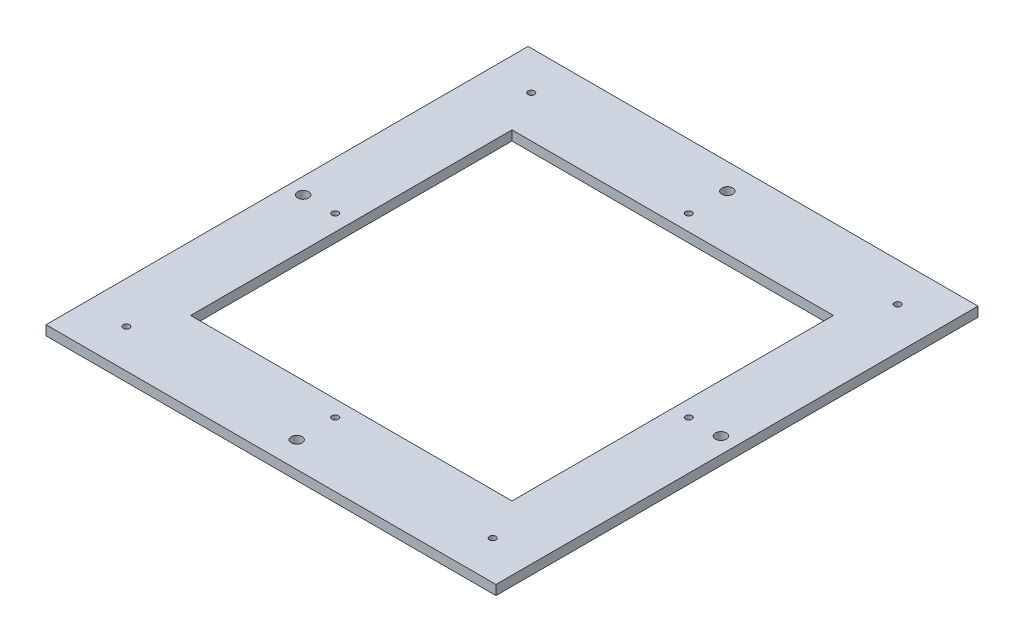
ISO-10303-21;
HEADER;
FILE_DESCRIPTION(('STEP AP214'),'2;1');
FILE_NAME('part.step','',(''),(''),'','','');
FILE_SCHEMA(('AUTOMOTIVE_DESIGN { 1 0 10303 214 1 1 1 1 }'));
ENDSEC;
DATA;
#1=APPLICATION_CONTEXT('core data for automotive mechanical design processes');
#2=APPLICATION_PROTOCOL_DEFINITION('international standard','automotive_design',2000,#1);
#3=PRODUCT_CONTEXT('',#1,'mechanical');
#4=PRODUCT('Part','Part','',(#3));
#5=PRODUCT_RELATED_PRODUCT_CATEGORY('part','',(#4));
#6=PRODUCT_DEFINITION_FORMATION('','',#4);
#7=PRODUCT_DEFINITION_CONTEXT('part definition',#1,'design');
#8=PRODUCT_DEFINITION('design','',#6,#7);
#9=PRODUCT_DEFINITION_SHAPE('','',#8);
#10=(LENGTH_UNIT() NAMED_UNIT(*) SI_UNIT(.MILLI.,.METRE.));
#11=(NAMED_UNIT(*) PLANE_ANGLE_UNIT() SI_UNIT($,.RADIAN.));
#12=(NAMED_UNIT(*) SI_UNIT($,.STERADIAN.) SOLID_ANGLE_UNIT());
#13=UNCERTAINTY_MEASURE_WITH_UNIT(LENGTH_MEASURE(1.E-05),#10,'distance_accuracy_value','');
#14=(GEOMETRIC_REPRESENTATION_CONTEXT(3) GLOBAL_UNCERTAINTY_ASSIGNED_CONTEXT((#13)) GLOBAL_UNIT_ASSIGNED_CONTEXT((#10,
#11,#12)) REPRESENTATION_CONTEXT('',''));
#15=CARTESIAN_POINT('',(0.,0.,0.));
#16=DIRECTION('',(0.,0.,1.));
#17=DIRECTION('',(1.,0.,0.));
#18=AXIS2_PLACEMENT_3D('',#15,#16,#17);
#19=CARTESIAN_POINT('',(12.,224.057982809084,290.032139168121));
#20=DIRECTION('',(0.,1.,0.));
#21=DIRECTION('',(0.,0.,1.));
#22=AXIS2_PLACEMENT_3D('',#19,#20,#21);
#23=PLANE('',#22);
#24=CARTESIAN_POINT('',(139.,224.057982809084,138.));
#25=DIRECTION('',(0.,-1.,0.));
#26=DIRECTION('',(0.,0.,-1.));
#27=AXIS2_PLACEMENT_3D('',#24,#25,#26);
#28=CIRCLE('',#27,1.);
#29=CARTESIAN_POINT('',(139.,224.057982809084,137.));
#30=VERTEX_POINT('',#29);
#31=EDGE_CURVE('E220',#30,#30,#28,.T.);
#32=ORIENTED_EDGE('',*,*,#31,.F.);
#33=EDGE_LOOP('',(#32));
#34=FACE_BOUND('',#33,.T.);
#35=CARTESIAN_POINT('',(25.,224.057982809084,138.));
#36=DIRECTION('',(0.,-1.,0.));
#37=DIRECTION('',(0.,0.,-1.));
#38=AXIS2_PLACEMENT_3D('',#35,#36,#37);
#39=CIRCLE('',#38,0.999999999999987);
#40=CARTESIAN_POINT('',(25.,224.057982809084,137.));
#41=VERTEX_POINT('',#40);
#42=EDGE_CURVE('E224',#41,#41,#39,.T.);
#43=ORIENTED_EDGE('',*,*,#42,.F.);
#44=EDGE_LOOP('',(#43));
#45=FACE_BOUND('',#44,.T.);
#46=CARTESIAN_POINT('',(82.,224.057982809084,130.));
#47=DIRECTION('',(0.,-1.,0.));
#48=DIRECTION('',(0.,0.,-1.));
#49=AXIS2_PLACEMENT_3D('',#46,#47,#48);
#50=CIRCLE('',#49,0.999999999999987);
#51=CARTESIAN_POINT('',(82.,224.057982809084,129.));
#52=VERTEX_POINT('',#51);
#53=EDGE_CURVE('E228',#52,#52,#50,.T.);
#54=ORIENTED_EDGE('',*,*,#53,.F.);
#55=EDGE_LOOP('',(#54));
#56=FACE_BOUND('',#55,.T.);
#57=CARTESIAN_POINT('',(27.,224.057982809084,75.));
#58=DIRECTION('',(0.,-1.,0.));
#59=DIRECTION('',(0.,0.,-1.));
#60=AXIS2_PLACEMENT_3D('',#57,#58,#59);
#61=CIRCLE('',#60,0.999999999999987);
#62=CARTESIAN_POINT('',(27.,224.057982809084,74.));
#63=VERTEX_POINT('',#62);
#64=EDGE_CURVE('E232',#63,#63,#61,.T.);
#65=ORIENTED_EDGE('',*,*,#64,.F.);
#66=EDGE_LOOP('',(#65));
#67=FACE_BOUND('',#66,.T.);
#68=CARTESIAN_POINT('',(137.,224.057982809084,75.));
#69=DIRECTION('',(0.,-1.,0.));
#70=DIRECTION('',(0.,0.,-1.));
#71=AXIS2_PLACEMENT_3D('',#68,#69,#70);
#72=CIRCLE('',#71,1.);
#73=CARTESIAN_POINT('',(137.,224.057982809084,74.));
#74=VERTEX_POINT('',#73);
#75=EDGE_CURVE('E236',#74,#74,#72,.T.);
#76=ORIENTED_EDGE('',*,*,#75,.F.);
#77=EDGE_LOOP('',(#76));
#78=FACE_BOUND('',#77,.T.);
#79=CARTESIAN_POINT('',(82.,224.057982809084,20.));
#80=DIRECTION('',(0.,-1.,0.));
#81=DIRECTION('',(0.,0.,-1.));
#82=AXIS2_PLACEMENT_3D('',#79,#80,#81);
#83=CIRCLE('',#82,0.999999999999987);
#84=CARTESIAN_POINT('',(82.,224.057982809084,19.));
#85=VERTEX_POINT('',#84);
#86=EDGE_CURVE('E240',#85,#85,#83,.T.);
#87=ORIENTED_EDGE('',*,*,#86,.F.);
#88=EDGE_LOOP('',(#87));
#89=FACE_BOUND('',#88,.T.);
#90=CARTESIAN_POINT('',(25.,224.057982809084,12.));
#91=DIRECTION('',(0.,-1.,0.));
#92=DIRECTION('',(0.,0.,-1.));
#93=AXIS2_PLACEMENT_3D('',#90,#91,#92);
#94=CIRCLE('',#93,0.999999999999987);
#95=CARTESIAN_POINT('',(25.,224.057982809084,11.));
#96=VERTEX_POINT('',#95);
#97=EDGE_CURVE('E244',#96,#96,#94,.T.);
#98=ORIENTED_EDGE('',*,*,#97,.F.);
#99=EDGE_LOOP('',(#98));
#100=FACE_BOUND('',#99,.T.);
#101=CARTESIAN_POINT('',(139.,224.057982809084,12.));
#102=DIRECTION('',(0.,-1.,0.));
#103=DIRECTION('',(0.,0.,-1.));
#104=AXIS2_PLACEMENT_3D('',#101,#102,#103);
#105=CIRCLE('',#104,1.);
#106=CARTESIAN_POINT('',(139.,224.057982809084,11.));
#107=VERTEX_POINT('',#106);
#108=EDGE_CURVE('E248',#107,#107,#105,.T.);
#109=ORIENTED_EDGE('',*,*,#108,.F.);
#110=EDGE_LOOP('',(#109));
#111=FACE_BOUND('',#110,.T.);
#112=CARTESIAN_POINT('',(82.,224.057982809084,142.));
#113=DIRECTION('',(0.,-1.,0.));
#114=DIRECTION('',(0.,0.,-1.));
#115=AXIS2_PLACEMENT_3D('',#112,#113,#114);
#116=CIRCLE('',#115,1.69999999999999);
#117=CARTESIAN_POINT('',(82.,224.057982809084,140.3));
#118=VERTEX_POINT('',#117);
#119=EDGE_CURVE('E252',#118,#118,#116,.T.);
#120=ORIENTED_EDGE('',*,*,#119,.F.);
#121=EDGE_LOOP('',(#120));
#122=FACE_BOUND('',#121,.T.);
#123=CARTESIAN_POINT('',(147.,224.057982809084,75.));
#124=DIRECTION('',(0.,-1.,0.));
#125=DIRECTION('',(0.,0.,-1.));
#126=AXIS2_PLACEMENT_3D('',#123,#124,#125);
#127=CIRCLE('',#126,1.70000000000001);
#128=CARTESIAN_POINT('',(147.,224.057982809084,73.3));
#129=VERTEX_POINT('',#128);
#130=EDGE_CURVE('E256',#129,#129,#127,.T.);
#131=ORIENTED_EDGE('',*,*,#130,.F.);
#132=EDGE_LOOP('',(#131));
#133=FACE_BOUND('',#132,.T.);
#134=CARTESIAN_POINT('',(82.,224.057982809084,7.99999999999998));
#135=DIRECTION('',(0.,-1.,0.));
#136=DIRECTION('',(0.,0.,-1.));
#137=AXIS2_PLACEMENT_3D('',#134,#135,#136);
#138=CIRCLE('',#137,1.69999999999999);
#139=CARTESIAN_POINT('',(82.,224.057982809084,6.29999999999999));
#140=VERTEX_POINT('',#139);
#141=EDGE_CURVE('E260',#140,#140,#138,.T.);
#142=ORIENTED_EDGE('',*,*,#141,.F.);
#143=EDGE_LOOP('',(#142));
#144=FACE_BOUND('',#143,.T.);
#145=CARTESIAN_POINT('',(17.,224.057982809084,75.));
#146=DIRECTION('',(0.,-1.,0.));
#147=DIRECTION('',(0.,0.,-1.));
#148=AXIS2_PLACEMENT_3D('',#145,#146,#147);
#149=CIRCLE('',#148,1.7);
#150=CARTESIAN_POINT('',(17.,224.057982809084,73.3));
#151=VERTEX_POINT('',#150);
#152=EDGE_CURVE('E264',#151,#151,#149,.T.);
#153=ORIENTED_EDGE('',*,*,#152,.F.);
#154=EDGE_LOOP('',(#153));
#155=FACE_BOUND('',#154,.T.);
#156=DIRECTION('',(-1.,0.,0.));
#157=VECTOR('',#156,1.);
#158=CARTESIAN_POINT('',(32.,224.057982809084,125.));
#159=LINE('',#158,#157);
#160=CARTESIAN_POINT('',(132.,224.057982809084,125.));
#161=VERTEX_POINT('',#160);
#162=CARTESIAN_POINT('',(32.,224.057982809084,125.));
#163=VERTEX_POINT('',#162);
#164=EDGE_CURVE('E127',#161,#163,#159,.T.);
#165=ORIENTED_EDGE('',*,*,#164,.F.);
#166=DIRECTION('',(0.,0.,1.));
#167=VECTOR('',#166,1.);
#168=CARTESIAN_POINT('',(132.,224.057982809084,125.));
#169=LINE('',#168,#167);
#170=CARTESIAN_POINT('',(132.,224.057982809084,25.));
#171=VERTEX_POINT('',#170);
#172=EDGE_CURVE('E54',#171,#161,#169,.T.);
#173=ORIENTED_EDGE('',*,*,#172,.F.);
#174=DIRECTION('',(1.,0.,0.));
#175=VECTOR('',#174,1.);
#176=CARTESIAN_POINT('',(32.,224.057982809084,25.));
#177=LINE('',#176,#175);
#178=CARTESIAN_POINT('',(32.,224.057982809084,25.));
#179=VERTEX_POINT('',#178);
#180=EDGE_CURVE('E117',#179,#171,#177,.T.);
#181=ORIENTED_EDGE('',*,*,#180,.F.);
#182=DIRECTION('',(0.,0.,-1.));
#183=VECTOR('',#182,1.);
#184=CARTESIAN_POINT('',(32.,224.057982809084,125.));
#185=LINE('',#184,#183);
#186=EDGE_CURVE('E135',#163,#179,#185,.T.);
#187=ORIENTED_EDGE('',*,*,#186,.F.);
#188=EDGE_LOOP('',(#165,#173,#181,#187));
#189=FACE_BOUND('',#188,.T.);
#190=DIRECTION('',(0.,0.,-1.));
#191=VECTOR('',#190,1.);
#192=CARTESIAN_POINT('',(152.,224.057982809084,290.032139168121));
#193=LINE('',#192,#191);
#194=CARTESIAN_POINT('',(152.,224.057982809084,150.));
#195=VERTEX_POINT('',#194);
#196=CARTESIAN_POINT('',(152.,224.057982809084,0.));
#197=VERTEX_POINT('',#196);
#198=EDGE_CURVE('E153',#195,#197,#193,.T.);
#199=ORIENTED_EDGE('',*,*,#198,.F.);
#200=DIRECTION('',(-1.,0.,0.));
#201=VECTOR('',#200,1.);
#202=CARTESIAN_POINT('',(12.,224.057982809084,150.));
#203=LINE('',#202,#201);
#204=CARTESIAN_POINT('',(12.,224.057982809084,150.));
#205=VERTEX_POINT('',#204);
#206=EDGE_CURVE('E47',#195,#205,#203,.T.);
#207=ORIENTED_EDGE('',*,*,#206,.T.);
#208=DIRECTION('',(0.,0.,-1.));
#209=VECTOR('',#208,1.);
#210=CARTESIAN_POINT('',(12.,224.057982809084,290.032139168121));
#211=LINE('',#210,#209);
#212=CARTESIAN_POINT('',(12.,224.057982809084,0.));
#213=VERTEX_POINT('',#212);
#214=EDGE_CURVE('E174',#205,#213,#211,.T.);
#215=ORIENTED_EDGE('',*,*,#214,.T.);
#216=DIRECTION('',(1.,0.,0.));
#217=VECTOR('',#216,1.);
#218=CARTESIAN_POINT('',(12.,224.057982809084,0.));
#219=LINE('',#218,#217);
#220=EDGE_CURVE('E110',#213,#197,#219,.T.);
#221=ORIENTED_EDGE('',*,*,#220,.T.);
#222=EDGE_LOOP('',(#199,#207,#215,#221));
#223=FACE_BOUND('',#222,.T.);
#224=ADVANCED_FACE('F39',(#34,#45,#56,#67,#78,#89,#100,#111,#122,#133,#144,#155,#189,#223),#23,.F.);
#225=CARTESIAN_POINT('',(152.,227.057982809084,290.032139168121));
#226=DIRECTION('',(1.,0.,0.));
#227=DIRECTION('',(0.,0.,-1.));
#228=AXIS2_PLACEMENT_3D('',#225,#226,#227);
#229=PLANE('',#228);
#230=DIRECTION('',(0.,1.,0.));
#231=VECTOR('',#230,1.);
#232=CARTESIAN_POINT('',(152.,227.057982809084,150.));
#233=LINE('',#232,#231);
#234=CARTESIAN_POINT('',(152.,227.057982809084,150.));
#235=VERTEX_POINT('',#234);
#236=EDGE_CURVE('E152',#195,#235,#233,.T.);
#237=ORIENTED_EDGE('',*,*,#236,.F.);
#238=ORIENTED_EDGE('',*,*,#198,.T.);
#239=DIRECTION('',(0.,-1.,0.));
#240=VECTOR('',#239,1.);
#241=CARTESIAN_POINT('',(152.,227.057982809084,0.));
#242=LINE('',#241,#240);
#243=CARTESIAN_POINT('',(152.,227.057982809084,0.));
#244=VERTEX_POINT('',#243);
#245=EDGE_CURVE('E162',#244,#197,#242,.T.);
#246=ORIENTED_EDGE('',*,*,#245,.F.);
#247=DIRECTION('',(0.,0.,-1.));
#248=VECTOR('',#247,1.);
#249=CARTESIAN_POINT('',(152.,227.057982809084,290.032139168121));
#250=LINE('',#249,#248);
#251=EDGE_CURVE('E180',#235,#244,#250,.T.);
#252=ORIENTED_EDGE('',*,*,#251,.F.);
#253=EDGE_LOOP('',(#237,#238,#246,#252));
#254=FACE_BOUND('',#253,.T.);
#255=ADVANCED_FACE('F187',(#254),#229,.T.);
#256=CARTESIAN_POINT('',(12.,227.057982809084,290.032139168121));
#257=DIRECTION('',(0.,1.,0.));
#258=DIRECTION('',(0.,0.,1.));
#259=AXIS2_PLACEMENT_3D('',#256,#257,#258);
#260=PLANE('',#259);
#261=CARTESIAN_POINT('',(139.,227.057982809084,138.));
#262=DIRECTION('',(0.,-1.,0.));
#263=DIRECTION('',(0.,0.,-1.));
#264=AXIS2_PLACEMENT_3D('',#261,#262,#263);
#265=CIRCLE('',#264,1.);
#266=CARTESIAN_POINT('',(139.,227.057982809084,137.));
#267=VERTEX_POINT('',#266);
#268=EDGE_CURVE('E338',#267,#267,#265,.T.);
#269=ORIENTED_EDGE('',*,*,#268,.T.);
#270=EDGE_LOOP('',(#269));
#271=FACE_BOUND('',#270,.T.);
#272=CARTESIAN_POINT('',(25.,227.057982809084,138.));
#273=DIRECTION('',(0.,-1.,0.));
#274=DIRECTION('',(0.,0.,-1.));
#275=AXIS2_PLACEMENT_3D('',#272,#273,#274);
#276=CIRCLE('',#275,0.999999999999987);
#277=CARTESIAN_POINT('',(25.,227.057982809084,137.));
#278=VERTEX_POINT('',#277);
#279=EDGE_CURVE('E332',#278,#278,#276,.T.);
#280=ORIENTED_EDGE('',*,*,#279,.T.);
#281=EDGE_LOOP('',(#280));
#282=FACE_BOUND('',#281,.T.);
#283=CARTESIAN_POINT('',(82.,227.057982809084,130.));
#284=DIRECTION('',(0.,-1.,0.));
#285=DIRECTION('',(0.,0.,-1.));
#286=AXIS2_PLACEMENT_3D('',#283,#284,#285);
#287=CIRCLE('',#286,0.999999999999987);
#288=CARTESIAN_POINT('',(82.,227.057982809084,129.));
#289=VERTEX_POINT('',#288);
#290=EDGE_CURVE('E326',#289,#289,#287,.T.);
#291=ORIENTED_EDGE('',*,*,#290,.T.);
#292=EDGE_LOOP('',(#291));
#293=FACE_BOUND('',#292,.T.);
#294=CARTESIAN_POINT('',(27.,227.057982809084,75.));
#295=DIRECTION('',(0.,-1.,0.));
#296=DIRECTION('',(0.,0.,-1.));
#297=AXIS2_PLACEMENT_3D('',#294,#295,#296);
#298=CIRCLE('',#297,0.999999999999987);
#299=CARTESIAN_POINT('',(27.,227.057982809084,74.));
#300=VERTEX_POINT('',#299);
#301=EDGE_CURVE('E320',#300,#300,#298,.T.);
#302=ORIENTED_EDGE('',*,*,#301,.T.);
#303=EDGE_LOOP('',(#302));
#304=FACE_BOUND('',#303,.T.);
#305=CARTESIAN_POINT('',(137.,227.057982809084,75.));
#306=DIRECTION('',(0.,-1.,0.));
#307=DIRECTION('',(0.,0.,-1.));
#308=AXIS2_PLACEMENT_3D('',#305,#306,#307);
#309=CIRCLE('',#308,1.);
#310=CARTESIAN_POINT('',(137.,227.057982809084,74.));
#311=VERTEX_POINT('',#310);
#312=EDGE_CURVE('E314',#311,#311,#309,.T.);
#313=ORIENTED_EDGE('',*,*,#312,.T.);
#314=EDGE_LOOP('',(#313));
#315=FACE_BOUND('',#314,.T.);
#316=CARTESIAN_POINT('',(82.,227.057982809084,20.));
#317=DIRECTION('',(0.,-1.,0.));
#318=DIRECTION('',(0.,0.,-1.));
#319=AXIS2_PLACEMENT_3D('',#316,#317,#318);
#320=CIRCLE('',#319,0.999999999999987);
#321=CARTESIAN_POINT('',(82.,227.057982809084,19.));
#322=VERTEX_POINT('',#321);
#323=EDGE_CURVE('E308',#322,#322,#320,.T.);
#324=ORIENTED_EDGE('',*,*,#323,.T.);
#325=EDGE_LOOP('',(#324));
#326=FACE_BOUND('',#325,.T.);
#327=CARTESIAN_POINT('',(25.,227.057982809084,12.));
#328=DIRECTION('',(0.,-1.,0.));
#329=DIRECTION('',(0.,0.,-1.));
#330=AXIS2_PLACEMENT_3D('',#327,#328,#329);
#331=CIRCLE('',#330,0.999999999999987);
#332=CARTESIAN_POINT('',(25.,227.057982809084,11.));
#333=VERTEX_POINT('',#332);
#334=EDGE_CURVE('E302',#333,#333,#331,.T.);
#335=ORIENTED_EDGE('',*,*,#334,.T.);
#336=EDGE_LOOP('',(#335));
#337=FACE_BOUND('',#336,.T.);
#338=CARTESIAN_POINT('',(139.,227.057982809084,12.));
#339=DIRECTION('',(0.,-1.,0.));
#340=DIRECTION('',(0.,0.,-1.));
#341=AXIS2_PLACEMENT_3D('',#338,#339,#340);
#342=CIRCLE('',#341,1.);
#343=CARTESIAN_POINT('',(139.,227.057982809084,11.));
#344=VERTEX_POINT('',#343);
#345=EDGE_CURVE('E296',#344,#344,#342,.T.);
#346=ORIENTED_EDGE('',*,*,#345,.T.);
#347=EDGE_LOOP('',(#346));
#348=FACE_BOUND('',#347,.T.);
#349=CARTESIAN_POINT('',(82.,227.057982809084,142.));
#350=DIRECTION('',(0.,-1.,0.));
#351=DIRECTION('',(0.,0.,-1.));
#352=AXIS2_PLACEMENT_3D('',#349,#350,#351);
#353=CIRCLE('',#352,1.69999999999999);
#354=CARTESIAN_POINT('',(82.,227.057982809084,140.3));
#355=VERTEX_POINT('',#354);
#356=EDGE_CURVE('E290',#355,#355,#353,.T.);
#357=ORIENTED_EDGE('',*,*,#356,.T.);
#358=EDGE_LOOP('',(#357));
#359=FACE_BOUND('',#358,.T.);
#360=CARTESIAN_POINT('',(147.,227.057982809084,75.));
#361=DIRECTION('',(0.,-1.,0.));
#362=DIRECTION('',(0.,0.,-1.));
#363=AXIS2_PLACEMENT_3D('',#360,#361,#362);
#364=CIRCLE('',#363,1.70000000000001);
#365=CARTESIAN_POINT('',(147.,227.057982809084,73.3));
#366=VERTEX_POINT('',#365);
#367=EDGE_CURVE('E284',#366,#366,#364,.T.);
#368=ORIENTED_EDGE('',*,*,#367,.T.);
#369=EDGE_LOOP('',(#368));
#370=FACE_BOUND('',#369,.T.);
#371=CARTESIAN_POINT('',(82.,227.057982809084,7.99999999999998));
#372=DIRECTION('',(0.,-1.,0.));
#373=DIRECTION('',(0.,0.,-1.));
#374=AXIS2_PLACEMENT_3D('',#371,#372,#373);
#375=CIRCLE('',#374,1.69999999999999);
#376=CARTESIAN_POINT('',(82.,227.057982809084,6.29999999999999));
#377=VERTEX_POINT('',#376);
#378=EDGE_CURVE('E278',#377,#377,#375,.T.);
#379=ORIENTED_EDGE('',*,*,#378,.T.);
#380=EDGE_LOOP('',(#379));
#381=FACE_BOUND('',#380,.T.);
#382=CARTESIAN_POINT('',(17.,227.057982809084,75.));
#383=DIRECTION('',(0.,-1.,0.));
#384=DIRECTION('',(0.,0.,-1.));
#385=AXIS2_PLACEMENT_3D('',#382,#383,#384);
#386=CIRCLE('',#385,1.7);
#387=CARTESIAN_POINT('',(17.,227.057982809084,73.3));
#388=VERTEX_POINT('',#387);
#389=EDGE_CURVE('E271',#388,#388,#386,.T.);
#390=ORIENTED_EDGE('',*,*,#389,.T.);
#391=EDGE_LOOP('',(#390));
#392=FACE_BOUND('',#391,.T.);
#393=DIRECTION('',(0.,0.,1.));
#394=VECTOR('',#393,1.);
#395=CARTESIAN_POINT('',(132.,227.057982809084,125.));
#396=LINE('',#395,#394);
#397=CARTESIAN_POINT('',(132.,227.057982809084,25.));
#398=VERTEX_POINT('',#397);
#399=CARTESIAN_POINT('',(132.,227.057982809084,125.));
#400=VERTEX_POINT('',#399);
#401=EDGE_CURVE('E114',#398,#400,#396,.T.);
#402=ORIENTED_EDGE('',*,*,#401,.T.);
#403=DIRECTION('',(-1.,0.,0.));
#404=VECTOR('',#403,1.);
#405=CARTESIAN_POINT('',(32.,227.057982809084,125.));
#406=LINE('',#405,#404);
#407=CARTESIAN_POINT('',(32.,227.057982809084,125.));
#408=VERTEX_POINT('',#407);
#409=EDGE_CURVE('E102',#400,#408,#406,.T.);
#410=ORIENTED_EDGE('',*,*,#409,.T.);
#411=DIRECTION('',(0.,0.,-1.));
#412=VECTOR('',#411,1.);
#413=CARTESIAN_POINT('',(32.,227.057982809084,125.));
#414=LINE('',#413,#412);
#415=CARTESIAN_POINT('',(32.,227.057982809084,25.));
#416=VERTEX_POINT('',#415);
#417=EDGE_CURVE('E129',#408,#416,#414,.T.);
#418=ORIENTED_EDGE('',*,*,#417,.T.);
#419=DIRECTION('',(1.,0.,0.));
#420=VECTOR('',#419,1.);
#421=CARTESIAN_POINT('',(32.,227.057982809084,25.));
#422=LINE('',#421,#420);
#423=EDGE_CURVE('E122',#416,#398,#422,.T.);
#424=ORIENTED_EDGE('',*,*,#423,.T.);
#425=EDGE_LOOP('',(#402,#410,#418,#424));
#426=FACE_BOUND('',#425,.T.);
#427=DIRECTION('',(-1.,0.,0.));
#428=VECTOR('',#427,1.);
#429=CARTESIAN_POINT('',(12.,227.057982809084,150.));
#430=LINE('',#429,#428);
#431=CARTESIAN_POINT('',(12.,227.057982809084,150.));
#432=VERTEX_POINT('',#431);
#433=EDGE_CURVE('E149',#235,#432,#430,.T.);
#434=ORIENTED_EDGE('',*,*,#433,.F.);
#435=ORIENTED_EDGE('',*,*,#251,.T.);
#436=DIRECTION('',(1.,0.,0.));
#437=VECTOR('',#436,1.);
#438=CARTESIAN_POINT('',(12.,227.057982809084,0.));
#439=LINE('',#438,#437);
#440=CARTESIAN_POINT('',(12.,227.057982809084,0.));
#441=VERTEX_POINT('',#440);
#442=EDGE_CURVE('E166',#441,#244,#439,.T.);
#443=ORIENTED_EDGE('',*,*,#442,.F.);
#444=DIRECTION('',(0.,0.,-1.));
#445=VECTOR('',#444,1.);
#446=CARTESIAN_POINT('',(12.,227.057982809084,290.032139168121));
#447=LINE('',#446,#445);
#448=EDGE_CURVE('E177',#432,#441,#447,.T.);
#449=ORIENTED_EDGE('',*,*,#448,.F.);
#450=EDGE_LOOP('',(#434,#435,#443,#449));
#451=FACE_BOUND('',#450,.T.);
#452=ADVANCED_FACE('F120',(#271,#282,#293,#304,#315,#326,#337,#348,#359,#370,#381,#392,#426,
#451),#260,.T.);
#453=CARTESIAN_POINT('',(12.,224.057982809084,290.032139168121));
#454=DIRECTION('',(-1.,0.,0.));
#455=DIRECTION('',(0.,0.,1.));
#456=AXIS2_PLACEMENT_3D('',#453,#454,#455);
#457=PLANE('',#456);
#458=DIRECTION('',(0.,-1.,0.));
#459=VECTOR('',#458,1.);
#460=CARTESIAN_POINT('',(12.,224.057982809084,150.));
#461=LINE('',#460,#459);
#462=EDGE_CURVE('E11',#432,#205,#461,.T.);
#463=ORIENTED_EDGE('',*,*,#462,.F.);
#464=ORIENTED_EDGE('',*,*,#448,.T.);
#465=DIRECTION('',(0.,1.,0.));
#466=VECTOR('',#465,1.);
#467=CARTESIAN_POINT('',(12.,224.057982809084,0.));
#468=LINE('',#467,#466);
#469=EDGE_CURVE('E170',#213,#441,#468,.T.);
#470=ORIENTED_EDGE('',*,*,#469,.F.);
#471=ORIENTED_EDGE('',*,*,#214,.F.);
#472=EDGE_LOOP('',(#463,#464,#470,#471));
#473=FACE_BOUND('',#472,.T.);
#474=ADVANCED_FACE('F202',(#473),#457,.T.);
#475=CARTESIAN_POINT('',(0.,0.,0.));
#476=DIRECTION('',(0.,0.,-1.));
#477=DIRECTION('',(-1.,0.,0.));
#478=AXIS2_PLACEMENT_3D('',#475,#476,#477);
#479=PLANE('',#478);
#480=ORIENTED_EDGE('',*,*,#220,.F.);
#481=ORIENTED_EDGE('',*,*,#469,.T.);
#482=ORIENTED_EDGE('',*,*,#442,.T.);
#483=ORIENTED_EDGE('',*,*,#245,.T.);
#484=EDGE_LOOP('',(#480,#481,#482,#483));
#485=FACE_BOUND('',#484,.T.);
#486=ADVANCED_FACE('F194',(#485),#479,.T.);
#487=CARTESIAN_POINT('',(0.,0.,150.));
#488=DIRECTION('',(0.,0.,-1.));
#489=DIRECTION('',(-1.,0.,0.));
#490=AXIS2_PLACEMENT_3D('',#487,#488,#489);
#491=PLANE('',#490);
#492=ORIENTED_EDGE('',*,*,#236,.T.);
#493=ORIENTED_EDGE('',*,*,#433,.T.);
#494=ORIENTED_EDGE('',*,*,#462,.T.);
#495=ORIENTED_EDGE('',*,*,#206,.F.);
#496=EDGE_LOOP('',(#492,#493,#494,#495));
#497=FACE_BOUND('',#496,.T.);
#498=ADVANCED_FACE('F200',(#497),#491,.F.);
#499=CARTESIAN_POINT('',(132.,227.058982809084,125.));
#500=DIRECTION('',(1.,0.,0.));
#501=DIRECTION('',(0.,0.,-1.));
#502=AXIS2_PLACEMENT_3D('',#499,#500,#501);
#503=PLANE('',#502);
#504=DIRECTION('',(0.,-1.,0.));
#505=VECTOR('',#504,1.);
#506=CARTESIAN_POINT('',(132.,227.058982809084,25.));
#507=LINE('',#506,#505);
#508=EDGE_CURVE('E111',#398,#171,#507,.T.);
#509=ORIENTED_EDGE('',*,*,#508,.T.);
#510=ORIENTED_EDGE('',*,*,#172,.T.);
#511=DIRECTION('',(0.,-1.,0.));
#512=VECTOR('',#511,1.);
#513=CARTESIAN_POINT('',(132.,227.058982809084,125.));
#514=LINE('',#513,#512);
#515=EDGE_CURVE('E104',#400,#161,#514,.T.);
#516=ORIENTED_EDGE('',*,*,#515,.F.);
#517=ORIENTED_EDGE('',*,*,#401,.F.);
#518=EDGE_LOOP('',(#509,#510,#516,#517));
#519=FACE_BOUND('',#518,.T.);
#520=ADVANCED_FACE('F113',(#519),#503,.F.);
#521=CARTESIAN_POINT('',(32.,227.058982809084,25.));
#522=DIRECTION('',(0.,0.,-1.));
#523=DIRECTION('',(-1.,0.,0.));
#524=AXIS2_PLACEMENT_3D('',#521,#522,#523);
#525=PLANE('',#524);
#526=DIRECTION('',(0.,-1.,0.));
#527=VECTOR('',#526,1.);
#528=CARTESIAN_POINT('',(32.,227.058982809084,25.));
#529=LINE('',#528,#527);
#530=EDGE_CURVE('E144',#416,#179,#529,.T.);
#531=ORIENTED_EDGE('',*,*,#530,.T.);
#532=ORIENTED_EDGE('',*,*,#180,.T.);
#533=ORIENTED_EDGE('',*,*,#508,.F.);
#534=ORIENTED_EDGE('',*,*,#423,.F.);
#535=EDGE_LOOP('',(#531,#532,#533,#534));
#536=FACE_BOUND('',#535,.T.);
#537=ADVANCED_FACE('F396',(#536),#525,.F.);
#538=CARTESIAN_POINT('',(32.,227.058982809084,125.));
#539=DIRECTION('',(-1.,0.,0.));
#540=DIRECTION('',(0.,0.,1.));
#541=AXIS2_PLACEMENT_3D('',#538,#539,#540);
#542=PLANE('',#541);
#543=DIRECTION('',(0.,-1.,0.));
#544=VECTOR('',#543,1.);
#545=CARTESIAN_POINT('',(32.,227.058982809084,125.));
#546=LINE('',#545,#544);
#547=EDGE_CURVE('E62',#408,#163,#546,.T.);
#548=ORIENTED_EDGE('',*,*,#547,.T.);
#549=ORIENTED_EDGE('',*,*,#186,.T.);
#550=ORIENTED_EDGE('',*,*,#530,.F.);
#551=ORIENTED_EDGE('',*,*,#417,.F.);
#552=EDGE_LOOP('',(#548,#549,#550,#551));
#553=FACE_BOUND('',#552,.T.);
#554=ADVANCED_FACE('F269',(#553),#542,.F.);
#555=CARTESIAN_POINT('',(32.,227.058982809084,125.));
#556=DIRECTION('',(0.,0.,1.));
#557=DIRECTION('',(1.,0.,0.));
#558=AXIS2_PLACEMENT_3D('',#555,#556,#557);
#559=PLANE('',#558);
#560=ORIENTED_EDGE('',*,*,#515,.T.);
#561=ORIENTED_EDGE('',*,*,#164,.T.);
#562=ORIENTED_EDGE('',*,*,#547,.F.);
#563=ORIENTED_EDGE('',*,*,#409,.F.);
#564=EDGE_LOOP('',(#560,#561,#562,#563));
#565=FACE_BOUND('',#564,.T.);
#566=ADVANCED_FACE('F103',(#565),#559,.F.);
#567=CARTESIAN_POINT('',(17.,224.057982809084,75.));
#568=DIRECTION('',(0.,-1.,0.));
#569=DIRECTION('',(0.,0.,-1.));
#570=AXIS2_PLACEMENT_3D('',#567,#568,#569);
#571=CYLINDRICAL_SURFACE('',#570,1.7);
#572=ORIENTED_EDGE('',*,*,#389,.F.);
#573=EDGE_LOOP('',(#572));
#574=FACE_BOUND('',#573,.T.);
#575=ORIENTED_EDGE('',*,*,#152,.T.);
#576=EDGE_LOOP('',(#575));
#577=FACE_BOUND('',#576,.T.);
#578=ADVANCED_FACE('F391',(#574,#577),#571,.F.);
#579=CARTESIAN_POINT('',(82.,224.057982809084,7.99999999999998));
#580=DIRECTION('',(0.,-1.,0.));
#581=DIRECTION('',(0.,0.,-1.));
#582=AXIS2_PLACEMENT_3D('',#579,#580,#581);
#583=CYLINDRICAL_SURFACE('',#582,1.69999999999999);
#584=ORIENTED_EDGE('',*,*,#378,.F.);
#585=EDGE_LOOP('',(#584));
#586=FACE_BOUND('',#585,.T.);
#587=ORIENTED_EDGE('',*,*,#141,.T.);
#588=EDGE_LOOP('',(#587));
#589=FACE_BOUND('',#588,.T.);
#590=ADVANCED_FACE('F387',(#586,#589),#583,.F.);
#591=CARTESIAN_POINT('',(147.,224.057982809084,75.));
#592=DIRECTION('',(0.,-1.,0.));
#593=DIRECTION('',(0.,0.,-1.));
#594=AXIS2_PLACEMENT_3D('',#591,#592,#593);
#595=CYLINDRICAL_SURFACE('',#594,1.70000000000001);
#596=ORIENTED_EDGE('',*,*,#367,.F.);
#597=EDGE_LOOP('',(#596));
#598=FACE_BOUND('',#597,.T.);
#599=ORIENTED_EDGE('',*,*,#130,.T.);
#600=EDGE_LOOP('',(#599));
#601=FACE_BOUND('',#600,.T.);
#602=ADVANCED_FACE('F383',(#598,#601),#595,.F.);
#603=CARTESIAN_POINT('',(82.,224.057982809084,142.));
#604=DIRECTION('',(0.,-1.,0.));
#605=DIRECTION('',(0.,0.,-1.));
#606=AXIS2_PLACEMENT_3D('',#603,#604,#605);
#607=CYLINDRICAL_SURFACE('',#606,1.69999999999999);
#608=ORIENTED_EDGE('',*,*,#356,.F.);
#609=EDGE_LOOP('',(#608));
#610=FACE_BOUND('',#609,.T.);
#611=ORIENTED_EDGE('',*,*,#119,.T.);
#612=EDGE_LOOP('',(#611));
#613=FACE_BOUND('',#612,.T.);
#614=ADVANCED_FACE('F379',(#610,#613),#607,.F.);
#615=CARTESIAN_POINT('',(139.,224.057982809084,12.));
#616=DIRECTION('',(0.,-1.,0.));
#617=DIRECTION('',(0.,0.,-1.));
#618=AXIS2_PLACEMENT_3D('',#615,#616,#617);
#619=CYLINDRICAL_SURFACE('',#618,1.);
#620=ORIENTED_EDGE('',*,*,#345,.F.);
#621=EDGE_LOOP('',(#620));
#622=FACE_BOUND('',#621,.T.);
#623=ORIENTED_EDGE('',*,*,#108,.T.);
#624=EDGE_LOOP('',(#623));
#625=FACE_BOUND('',#624,.T.);
#626=ADVANCED_FACE('F375',(#622,#625),#619,.F.);
#627=CARTESIAN_POINT('',(25.,224.057982809084,12.));
#628=DIRECTION('',(0.,-1.,0.));
#629=DIRECTION('',(0.,0.,-1.));
#630=AXIS2_PLACEMENT_3D('',#627,#628,#629);
#631=CYLINDRICAL_SURFACE('',#630,0.999999999999987);
#632=ORIENTED_EDGE('',*,*,#334,.F.);
#633=EDGE_LOOP('',(#632));
#634=FACE_BOUND('',#633,.T.);
#635=ORIENTED_EDGE('',*,*,#97,.T.);
#636=EDGE_LOOP('',(#635));
#637=FACE_BOUND('',#636,.T.);
#638=ADVANCED_FACE('F371',(#634,#637),#631,.F.);
#639=CARTESIAN_POINT('',(82.,224.057982809084,20.));
#640=DIRECTION('',(0.,-1.,0.));
#641=DIRECTION('',(0.,0.,-1.));
#642=AXIS2_PLACEMENT_3D('',#639,#640,#641);
#643=CYLINDRICAL_SURFACE('',#642,0.999999999999987);
#644=ORIENTED_EDGE('',*,*,#323,.F.);
#645=EDGE_LOOP('',(#644));
#646=FACE_BOUND('',#645,.T.);
#647=ORIENTED_EDGE('',*,*,#86,.T.);
#648=EDGE_LOOP('',(#647));
#649=FACE_BOUND('',#648,.T.);
#650=ADVANCED_FACE('F367',(#646,#649),#643,.F.);
#651=CARTESIAN_POINT('',(137.,224.057982809084,75.));
#652=DIRECTION('',(0.,-1.,0.));
#653=DIRECTION('',(0.,0.,-1.));
#654=AXIS2_PLACEMENT_3D('',#651,#652,#653);
#655=CYLINDRICAL_SURFACE('',#654,1.);
#656=ORIENTED_EDGE('',*,*,#312,.F.);
#657=EDGE_LOOP('',(#656));
#658=FACE_BOUND('',#657,.T.);
#659=ORIENTED_EDGE('',*,*,#75,.T.);
#660=EDGE_LOOP('',(#659));
#661=FACE_BOUND('',#660,.T.);
#662=ADVANCED_FACE('F363',(#658,#661),#655,.F.);
#663=CARTESIAN_POINT('',(27.,224.057982809084,75.));
#664=DIRECTION('',(0.,-1.,0.));
#665=DIRECTION('',(0.,0.,-1.));
#666=AXIS2_PLACEMENT_3D('',#663,#664,#665);
#667=CYLINDRICAL_SURFACE('',#666,0.999999999999987);
#668=ORIENTED_EDGE('',*,*,#301,.F.);
#669=EDGE_LOOP('',(#668));
#670=FACE_BOUND('',#669,.T.);
#671=ORIENTED_EDGE('',*,*,#64,.T.);
#672=EDGE_LOOP('',(#671));
#673=FACE_BOUND('',#672,.T.);
#674=ADVANCED_FACE('F359',(#670,#673),#667,.F.);
#675=CARTESIAN_POINT('',(82.,224.057982809084,130.));
#676=DIRECTION('',(0.,-1.,0.));
#677=DIRECTION('',(0.,0.,-1.));
#678=AXIS2_PLACEMENT_3D('',#675,#676,#677);
#679=CYLINDRICAL_SURFACE('',#678,0.999999999999987);
#680=ORIENTED_EDGE('',*,*,#290,.F.);
#681=EDGE_LOOP('',(#680));
#682=FACE_BOUND('',#681,.T.);
#683=ORIENTED_EDGE('',*,*,#53,.T.);
#684=EDGE_LOOP('',(#683));
#685=FACE_BOUND('',#684,.T.);
#686=ADVANCED_FACE('F352',(#682,#685),#679,.F.);
#687=CARTESIAN_POINT('',(25.,224.057982809084,138.));
#688=DIRECTION('',(0.,-1.,0.));
#689=DIRECTION('',(0.,0.,-1.));
#690=AXIS2_PLACEMENT_3D('',#687,#688,#689);
#691=CYLINDRICAL_SURFACE('',#690,0.999999999999987);
#692=ORIENTED_EDGE('',*,*,#279,.F.);
#693=EDGE_LOOP('',(#692));
#694=FACE_BOUND('',#693,.T.);
#695=ORIENTED_EDGE('',*,*,#42,.T.);
#696=EDGE_LOOP('',(#695));
#697=FACE_BOUND('',#696,.T.);
#698=ADVANCED_FACE('F346',(#694,#697),#691,.F.);
#699=CARTESIAN_POINT('',(139.,224.057982809084,138.));
#700=DIRECTION('',(0.,-1.,0.));
#701=DIRECTION('',(0.,0.,-1.));
#702=AXIS2_PLACEMENT_3D('',#699,#700,#701);
#703=CYLINDRICAL_SURFACE('',#702,1.);
#704=ORIENTED_EDGE('',*,*,#268,.F.);
#705=EDGE_LOOP('',(#704));
#706=FACE_BOUND('',#705,.T.);
#707=ORIENTED_EDGE('',*,*,#31,.T.);
#708=EDGE_LOOP('',(#707));
#709=FACE_BOUND('',#708,.T.);
#710=ADVANCED_FACE('F344',(#706,#709),#703,.F.);
#711=CLOSED_SHELL('',(#224,#255,#452,#474,#486,#498,#520,#537,#554,#566,#578,#590,#602,#614,
#626,#638,#650,#662,#674,#686,#698,#710));
#712=MANIFOLD_SOLID_BREP('B2',#711);
#713=ADVANCED_BREP_SHAPE_REPRESENTATION('',(#18,#712),#14);
#714=SHAPE_DEFINITION_REPRESENTATION(#9,#713);
ENDSEC;
END-ISO-10303-21;
